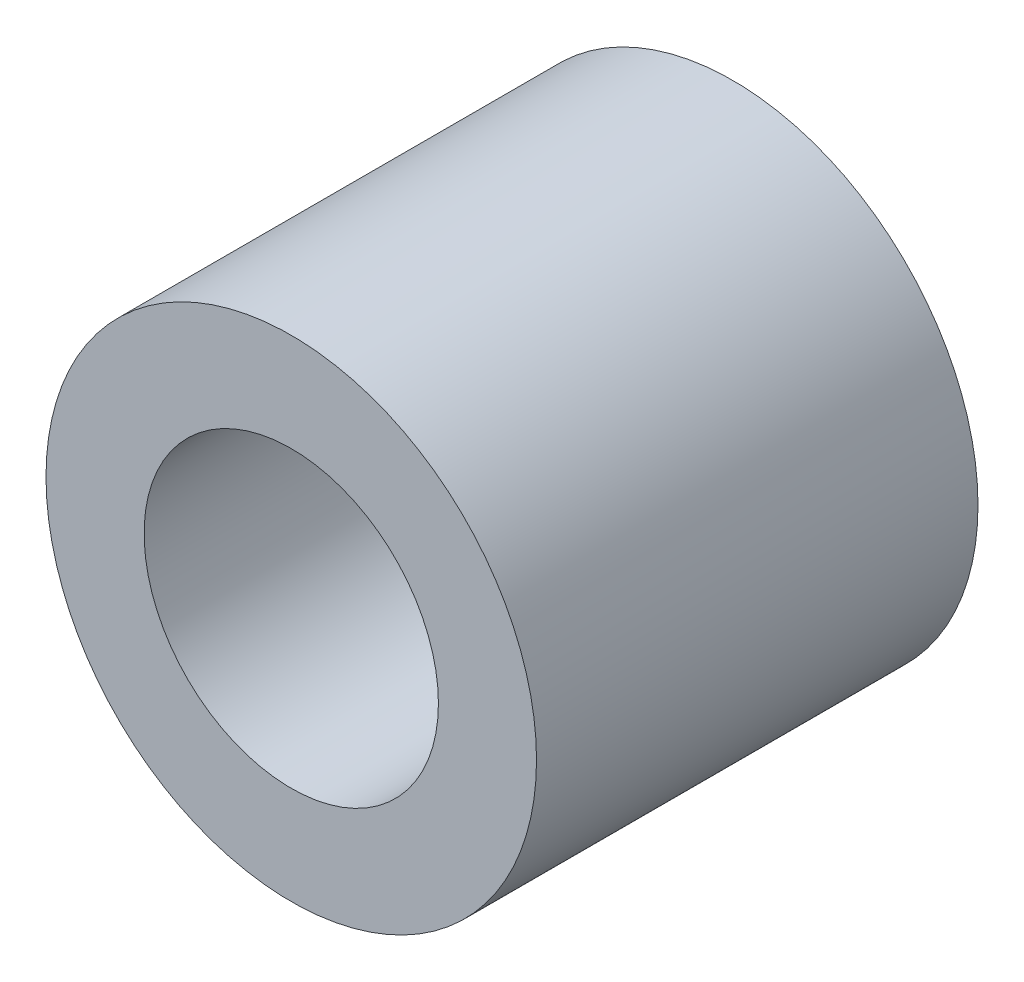
ISO-10303-21;
HEADER;
FILE_DESCRIPTION(('STEP AP214'),'2;1');
FILE_NAME('part.step','',(''),(''),'','','');
FILE_SCHEMA(('AUTOMOTIVE_DESIGN { 1 0 10303 214 1 1 1 1 }'));
ENDSEC;
DATA;
#1=APPLICATION_CONTEXT('core data for automotive mechanical design processes');
#2=APPLICATION_PROTOCOL_DEFINITION('international standard','automotive_design',2000,#1);
#3=PRODUCT_CONTEXT('',#1,'mechanical');
#4=PRODUCT('Part','Part','',(#3));
#5=PRODUCT_RELATED_PRODUCT_CATEGORY('part','',(#4));
#6=PRODUCT_DEFINITION_FORMATION('','',#4);
#7=PRODUCT_DEFINITION_CONTEXT('part definition',#1,'design');
#8=PRODUCT_DEFINITION('design','',#6,#7);
#9=PRODUCT_DEFINITION_SHAPE('','',#8);
#10=(LENGTH_UNIT() NAMED_UNIT(*) SI_UNIT(.MILLI.,.METRE.));
#11=(NAMED_UNIT(*) PLANE_ANGLE_UNIT() SI_UNIT($,.RADIAN.));
#12=(NAMED_UNIT(*) SI_UNIT($,.STERADIAN.) SOLID_ANGLE_UNIT());
#13=UNCERTAINTY_MEASURE_WITH_UNIT(LENGTH_MEASURE(1.E-05),#10,'distance_accuracy_value','');
#14=(GEOMETRIC_REPRESENTATION_CONTEXT(3) GLOBAL_UNCERTAINTY_ASSIGNED_CONTEXT((#13)) GLOBAL_UNIT_ASSIGNED_CONTEXT((#10,
#11,#12)) REPRESENTATION_CONTEXT('',''));
#15=CARTESIAN_POINT('',(0.,0.,0.));
#16=DIRECTION('',(0.,0.,1.));
#17=DIRECTION('',(1.,0.,0.));
#18=AXIS2_PLACEMENT_3D('',#15,#16,#17);
#19=CARTESIAN_POINT('',(0.,0.,4.5));
#20=DIRECTION('',(0.,0.,1.));
#21=DIRECTION('',(1.,0.,0.));
#22=AXIS2_PLACEMENT_3D('',#19,#20,#21);
#23=PLANE('',#22);
#24=CARTESIAN_POINT('',(0.,0.,4.5));
#25=DIRECTION('',(0.,0.,1.));
#26=DIRECTION('',(1.,0.,0.));
#27=AXIS2_PLACEMENT_3D('',#24,#25,#26);
#28=CIRCLE('',#27,2.5);
#29=CARTESIAN_POINT('',(2.5,0.,4.5));
#30=VERTEX_POINT('',#29);
#31=EDGE_CURVE('E10',#30,#30,#28,.T.);
#32=ORIENTED_EDGE('',*,*,#31,.T.);
#33=EDGE_LOOP('',(#32));
#34=FACE_BOUND('',#33,.T.);
#35=CARTESIAN_POINT('',(0.,0.,4.5));
#36=DIRECTION('',(0.,0.,1.));
#37=DIRECTION('',(1.,0.,0.));
#38=AXIS2_PLACEMENT_3D('',#35,#36,#37);
#39=CIRCLE('',#38,1.5);
#40=CARTESIAN_POINT('',(1.5,0.,4.5));
#41=VERTEX_POINT('',#40);
#42=EDGE_CURVE('E44',#41,#41,#39,.T.);
#43=ORIENTED_EDGE('',*,*,#42,.F.);
#44=EDGE_LOOP('',(#43));
#45=FACE_BOUND('',#44,.T.);
#46=ADVANCED_FACE('F33',(#34,#45),#23,.T.);
#47=CARTESIAN_POINT('',(0.,0.,0.));
#48=DIRECTION('',(0.,0.,1.));
#49=DIRECTION('',(1.,0.,0.));
#50=AXIS2_PLACEMENT_3D('',#47,#48,#49);
#51=PLANE('',#50);
#52=CARTESIAN_POINT('',(0.,0.,0.));
#53=DIRECTION('',(0.,0.,1.));
#54=DIRECTION('',(1.,0.,0.));
#55=AXIS2_PLACEMENT_3D('',#52,#53,#54);
#56=CIRCLE('',#55,2.5);
#57=CARTESIAN_POINT('',(2.5,0.,0.));
#58=VERTEX_POINT('',#57);
#59=EDGE_CURVE('E37',#58,#58,#56,.T.);
#60=ORIENTED_EDGE('',*,*,#59,.F.);
#61=EDGE_LOOP('',(#60));
#62=FACE_BOUND('',#61,.T.);
#63=CARTESIAN_POINT('',(0.,0.,0.));
#64=DIRECTION('',(0.,0.,1.));
#65=DIRECTION('',(1.,0.,0.));
#66=AXIS2_PLACEMENT_3D('',#63,#64,#65);
#67=CIRCLE('',#66,1.5);
#68=CARTESIAN_POINT('',(1.5,0.,0.));
#69=VERTEX_POINT('',#68);
#70=EDGE_CURVE('E46',#69,#69,#67,.T.);
#71=ORIENTED_EDGE('',*,*,#70,.T.);
#72=EDGE_LOOP('',(#71));
#73=FACE_BOUND('',#72,.T.);
#74=ADVANCED_FACE('F56',(#62,#73),#51,.F.);
#75=CARTESIAN_POINT('',(0.,0.,4.5));
#76=DIRECTION('',(0.,0.,-1.));
#77=DIRECTION('',(-1.,0.,0.));
#78=AXIS2_PLACEMENT_3D('',#75,#76,#77);
#79=CYLINDRICAL_SURFACE('',#78,2.5);
#80=ORIENTED_EDGE('',*,*,#31,.F.);
#81=EDGE_LOOP('',(#80));
#82=FACE_BOUND('',#81,.T.);
#83=ORIENTED_EDGE('',*,*,#59,.T.);
#84=EDGE_LOOP('',(#83));
#85=FACE_BOUND('',#84,.T.);
#86=ADVANCED_FACE('F35',(#82,#85),#79,.T.);
#87=CARTESIAN_POINT('',(0.,0.,4.5));
#88=DIRECTION('',(0.,0.,-1.));
#89=DIRECTION('',(-1.,0.,0.));
#90=AXIS2_PLACEMENT_3D('',#87,#88,#89);
#91=CYLINDRICAL_SURFACE('',#90,1.5);
#92=ORIENTED_EDGE('',*,*,#42,.T.);
#93=EDGE_LOOP('',(#92));
#94=FACE_BOUND('',#93,.T.);
#95=ORIENTED_EDGE('',*,*,#70,.F.);
#96=EDGE_LOOP('',(#95));
#97=FACE_BOUND('',#96,.T.);
#98=ADVANCED_FACE('F52',(#94,#97),#91,.F.);
#99=CLOSED_SHELL('',(#46,#74,#86,#98));
#100=MANIFOLD_SOLID_BREP('B2',#99);
#101=ADVANCED_BREP_SHAPE_REPRESENTATION('',(#18,#100),#14);
#102=SHAPE_DEFINITION_REPRESENTATION(#9,#101);
ENDSEC;
END-ISO-10303-21;
